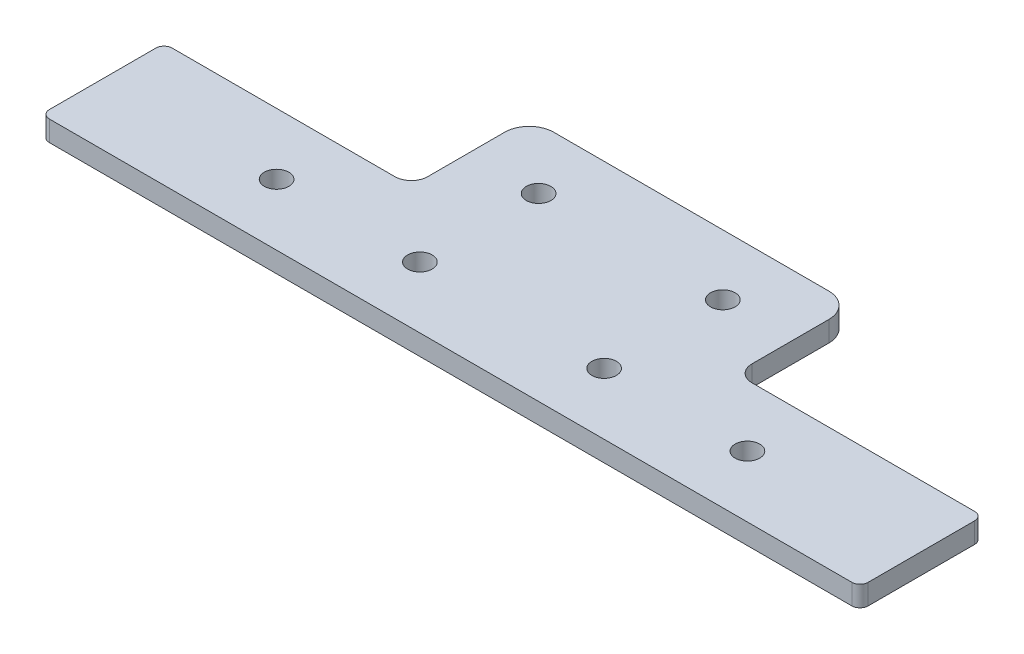
ISO-10303-21;
HEADER;
FILE_DESCRIPTION(('STEP AP214'),'2;1');
FILE_NAME('part.step','',(''),(''),'','','');
FILE_SCHEMA(('AUTOMOTIVE_DESIGN { 1 0 10303 214 1 1 1 1 }'));
ENDSEC;
DATA;
#1=APPLICATION_CONTEXT('core data for automotive mechanical design processes');
#2=APPLICATION_PROTOCOL_DEFINITION('international standard','automotive_design',2000,#1);
#3=PRODUCT_CONTEXT('',#1,'mechanical');
#4=PRODUCT('Part','Part','',(#3));
#5=PRODUCT_RELATED_PRODUCT_CATEGORY('part','',(#4));
#6=PRODUCT_DEFINITION_FORMATION('','',#4);
#7=PRODUCT_DEFINITION_CONTEXT('part definition',#1,'design');
#8=PRODUCT_DEFINITION('design','',#6,#7);
#9=PRODUCT_DEFINITION_SHAPE('','',#8);
#10=(LENGTH_UNIT() NAMED_UNIT(*) SI_UNIT(.MILLI.,.METRE.));
#11=(NAMED_UNIT(*) PLANE_ANGLE_UNIT() SI_UNIT($,.RADIAN.));
#12=(NAMED_UNIT(*) SI_UNIT($,.STERADIAN.) SOLID_ANGLE_UNIT());
#13=UNCERTAINTY_MEASURE_WITH_UNIT(LENGTH_MEASURE(1.E-05),#10,'distance_accuracy_value','');
#14=(GEOMETRIC_REPRESENTATION_CONTEXT(3) GLOBAL_UNCERTAINTY_ASSIGNED_CONTEXT((#13)) GLOBAL_UNIT_ASSIGNED_CONTEXT((#10,
#11,#12)) REPRESENTATION_CONTEXT('',''));
#15=CARTESIAN_POINT('',(0.,0.,0.));
#16=DIRECTION('',(0.,0.,1.));
#17=DIRECTION('',(1.,0.,0.));
#18=AXIS2_PLACEMENT_3D('',#15,#16,#17);
#19=CARTESIAN_POINT('',(-63.5,3.175,-9.525));
#20=DIRECTION('',(0.,0.,1.));
#21=DIRECTION('',(1.,0.,0.));
#22=AXIS2_PLACEMENT_3D('',#19,#20,#21);
#23=PLANE('',#22);
#24=DIRECTION('',(-1.,0.,0.));
#25=VECTOR('',#24,1.);
#26=CARTESIAN_POINT('',(-63.5,3.175,-9.525));
#27=LINE('',#26,#25);
#28=CARTESIAN_POINT('',(-27.686,3.175,-9.525));
#29=VERTEX_POINT('',#28);
#30=CARTESIAN_POINT('',(-62.23,3.175,-9.525));
#31=VERTEX_POINT('',#30);
#32=EDGE_CURVE('E280',#29,#31,#27,.T.);
#33=ORIENTED_EDGE('',*,*,#32,.F.);
#34=DIRECTION('',(0.,1.,0.));
#35=VECTOR('',#34,1.);
#36=CARTESIAN_POINT('',(-27.686,3.175,-9.525));
#37=LINE('',#36,#35);
#38=CARTESIAN_POINT('',(-27.686,0.,-9.525));
#39=VERTEX_POINT('',#38);
#40=EDGE_CURVE('E226',#29,#39,#37,.F.);
#41=ORIENTED_EDGE('',*,*,#40,.T.);
#42=DIRECTION('',(-1.,0.,0.));
#43=VECTOR('',#42,1.);
#44=CARTESIAN_POINT('',(-63.5,0.,-9.525));
#45=LINE('',#44,#43);
#46=CARTESIAN_POINT('',(-62.23,0.,-9.525));
#47=VERTEX_POINT('',#46);
#48=EDGE_CURVE('E178',#39,#47,#45,.T.);
#49=ORIENTED_EDGE('',*,*,#48,.T.);
#50=DIRECTION('',(0.,-1.,0.));
#51=VECTOR('',#50,1.);
#52=CARTESIAN_POINT('',(-62.23,3.175,-9.525));
#53=LINE('',#52,#51);
#54=EDGE_CURVE('E216',#47,#31,#53,.F.);
#55=ORIENTED_EDGE('',*,*,#54,.T.);
#56=EDGE_LOOP('',(#33,#41,#49,#55));
#57=FACE_BOUND('',#56,.T.);
#58=ADVANCED_FACE('F34',(#57),#23,.F.);
#59=CARTESIAN_POINT('',(63.5,3.175,9.525));
#60=DIRECTION('',(-1.,0.,0.));
#61=DIRECTION('',(0.,0.,1.));
#62=AXIS2_PLACEMENT_3D('',#59,#60,#61);
#63=PLANE('',#62);
#64=DIRECTION('',(0.,0.,-1.));
#65=VECTOR('',#64,1.);
#66=CARTESIAN_POINT('',(63.5,0.,9.525));
#67=LINE('',#66,#65);
#68=CARTESIAN_POINT('',(63.5,0.,8.255));
#69=VERTEX_POINT('',#68);
#70=CARTESIAN_POINT('',(63.5,0.,-8.255));
#71=VERTEX_POINT('',#70);
#72=EDGE_CURVE('E183',#69,#71,#67,.T.);
#73=ORIENTED_EDGE('',*,*,#72,.T.);
#74=DIRECTION('',(0.,-1.,0.));
#75=VECTOR('',#74,1.);
#76=CARTESIAN_POINT('',(63.5,3.175,-8.255));
#77=LINE('',#76,#75);
#78=CARTESIAN_POINT('',(63.5,3.175,-8.255));
#79=VERTEX_POINT('',#78);
#80=EDGE_CURVE('E155',#71,#79,#77,.F.);
#81=ORIENTED_EDGE('',*,*,#80,.T.);
#82=DIRECTION('',(0.,0.,-1.));
#83=VECTOR('',#82,1.);
#84=CARTESIAN_POINT('',(63.5,3.175,9.525));
#85=LINE('',#84,#83);
#86=CARTESIAN_POINT('',(63.5,3.175,8.255));
#87=VERTEX_POINT('',#86);
#88=EDGE_CURVE('E188',#87,#79,#85,.T.);
#89=ORIENTED_EDGE('',*,*,#88,.F.);
#90=DIRECTION('',(0.,-1.,0.));
#91=VECTOR('',#90,1.);
#92=CARTESIAN_POINT('',(63.5,3.175,8.255));
#93=LINE('',#92,#91);
#94=EDGE_CURVE('E159',#87,#69,#93,.T.);
#95=ORIENTED_EDGE('',*,*,#94,.T.);
#96=EDGE_LOOP('',(#73,#81,#89,#95));
#97=FACE_BOUND('',#96,.T.);
#98=ADVANCED_FACE('F296',(#97),#63,.F.);
#99=CARTESIAN_POINT('',(62.23,0.,-9.525));
#100=VERTEX_POINT('',#99);
#101=CARTESIAN_POINT('',(27.6859999999999,0.,-9.525));
#102=VERTEX_POINT('',#101);
#103=EDGE_CURVE('E167',#100,#102,#45,.T.);
#104=ORIENTED_EDGE('',*,*,#103,.T.);
#105=DIRECTION('',(0.,1.,0.));
#106=VECTOR('',#105,1.);
#107=CARTESIAN_POINT('',(27.6859999999999,3.175,-9.525));
#108=LINE('',#107,#106);
#109=CARTESIAN_POINT('',(27.6859999999999,3.175,-9.525));
#110=VERTEX_POINT('',#109);
#111=EDGE_CURVE('E219',#102,#110,#108,.T.);
#112=ORIENTED_EDGE('',*,*,#111,.T.);
#113=CARTESIAN_POINT('',(62.23,3.175,-9.525));
#114=VERTEX_POINT('',#113);
#115=EDGE_CURVE('E170',#114,#110,#27,.T.);
#116=ORIENTED_EDGE('',*,*,#115,.F.);
#117=DIRECTION('',(0.,-1.,0.));
#118=VECTOR('',#117,1.);
#119=CARTESIAN_POINT('',(62.23,3.175,-9.525));
#120=LINE('',#119,#118);
#121=EDGE_CURVE('E154',#114,#100,#120,.T.);
#122=ORIENTED_EDGE('',*,*,#121,.T.);
#123=EDGE_LOOP('',(#104,#112,#116,#122));
#124=FACE_BOUND('',#123,.T.);
#125=ADVANCED_FACE('F165',(#124),#23,.F.);
#126=CARTESIAN_POINT('',(-63.5,3.175,9.525));
#127=DIRECTION('',(1.,0.,0.));
#128=DIRECTION('',(0.,0.,-1.));
#129=AXIS2_PLACEMENT_3D('',#126,#127,#128);
#130=PLANE('',#129);
#131=DIRECTION('',(0.,0.,1.));
#132=VECTOR('',#131,1.);
#133=CARTESIAN_POINT('',(-63.5,3.175,9.525));
#134=LINE('',#133,#132);
#135=CARTESIAN_POINT('',(-63.5,3.175,-8.255));
#136=VERTEX_POINT('',#135);
#137=CARTESIAN_POINT('',(-63.5,3.175,8.255));
#138=VERTEX_POINT('',#137);
#139=EDGE_CURVE('E282',#136,#138,#134,.T.);
#140=ORIENTED_EDGE('',*,*,#139,.F.);
#141=DIRECTION('',(0.,-1.,0.));
#142=VECTOR('',#141,1.);
#143=CARTESIAN_POINT('',(-63.5,3.175,-8.255));
#144=LINE('',#143,#142);
#145=CARTESIAN_POINT('',(-63.5,0.,-8.255));
#146=VERTEX_POINT('',#145);
#147=EDGE_CURVE('E213',#136,#146,#144,.T.);
#148=ORIENTED_EDGE('',*,*,#147,.T.);
#149=DIRECTION('',(0.,0.,1.));
#150=VECTOR('',#149,1.);
#151=CARTESIAN_POINT('',(-63.5,0.,9.525));
#152=LINE('',#151,#150);
#153=CARTESIAN_POINT('',(-63.5,0.,8.255));
#154=VERTEX_POINT('',#153);
#155=EDGE_CURVE('E177',#146,#154,#152,.T.);
#156=ORIENTED_EDGE('',*,*,#155,.T.);
#157=DIRECTION('',(0.,-1.,0.));
#158=VECTOR('',#157,1.);
#159=CARTESIAN_POINT('',(-63.5,3.175,8.255));
#160=LINE('',#159,#158);
#161=EDGE_CURVE('E211',#154,#138,#160,.F.);
#162=ORIENTED_EDGE('',*,*,#161,.T.);
#163=EDGE_LOOP('',(#140,#148,#156,#162));
#164=FACE_BOUND('',#163,.T.);
#165=ADVANCED_FACE('F305',(#164),#130,.F.);
#166=CARTESIAN_POINT('',(-63.5,3.175,9.525));
#167=DIRECTION('',(0.,0.,-1.));
#168=DIRECTION('',(-1.,0.,0.));
#169=AXIS2_PLACEMENT_3D('',#166,#167,#168);
#170=PLANE('',#169);
#171=DIRECTION('',(1.,0.,0.));
#172=VECTOR('',#171,1.);
#173=CARTESIAN_POINT('',(-63.5,0.,9.525));
#174=LINE('',#173,#172);
#175=CARTESIAN_POINT('',(-62.23,0.,9.525));
#176=VERTEX_POINT('',#175);
#177=CARTESIAN_POINT('',(62.23,0.,9.525));
#178=VERTEX_POINT('',#177);
#179=EDGE_CURVE('E181',#176,#178,#174,.T.);
#180=ORIENTED_EDGE('',*,*,#179,.T.);
#181=DIRECTION('',(0.,-1.,0.));
#182=VECTOR('',#181,1.);
#183=CARTESIAN_POINT('',(62.23,3.175,9.525));
#184=LINE('',#183,#182);
#185=CARTESIAN_POINT('',(62.23,3.175,9.525));
#186=VERTEX_POINT('',#185);
#187=EDGE_CURVE('E209',#178,#186,#184,.F.);
#188=ORIENTED_EDGE('',*,*,#187,.T.);
#189=DIRECTION('',(1.,0.,0.));
#190=VECTOR('',#189,1.);
#191=CARTESIAN_POINT('',(-63.5,3.175,9.525));
#192=LINE('',#191,#190);
#193=CARTESIAN_POINT('',(-62.23,3.175,9.525));
#194=VERTEX_POINT('',#193);
#195=EDGE_CURVE('E172',#194,#186,#192,.T.);
#196=ORIENTED_EDGE('',*,*,#195,.F.);
#197=DIRECTION('',(0.,-1.,0.));
#198=VECTOR('',#197,1.);
#199=CARTESIAN_POINT('',(-62.23,3.175,9.525));
#200=LINE('',#199,#198);
#201=EDGE_CURVE('E206',#194,#176,#200,.T.);
#202=ORIENTED_EDGE('',*,*,#201,.T.);
#203=EDGE_LOOP('',(#180,#188,#196,#202));
#204=FACE_BOUND('',#203,.T.);
#205=ADVANCED_FACE('F298',(#204),#170,.F.);
#206=CARTESIAN_POINT('',(0.,3.175,0.));
#207=DIRECTION('',(0.,-1.,0.));
#208=DIRECTION('',(0.,0.,-1.));
#209=AXIS2_PLACEMENT_3D('',#206,#207,#208);
#210=PLANE('',#209);
#211=CARTESIAN_POINT('',(-36.5125,3.175,0.));
#212=DIRECTION('',(0.,1.,0.));
#213=DIRECTION('',(0.,0.,1.));
#214=AXIS2_PLACEMENT_3D('',#211,#212,#213);
#215=CIRCLE('',#214,1.905);
#216=CARTESIAN_POINT('',(-36.5125,3.175,1.905));
#217=VERTEX_POINT('',#216);
#218=EDGE_CURVE('E273',#217,#217,#215,.T.);
#219=ORIENTED_EDGE('',*,*,#218,.F.);
#220=EDGE_LOOP('',(#219));
#221=FACE_BOUND('',#220,.T.);
#222=CARTESIAN_POINT('',(14.2875,3.175,-18.415));
#223=DIRECTION('',(0.,1.,0.));
#224=DIRECTION('',(0.,0.,1.));
#225=AXIS2_PLACEMENT_3D('',#222,#223,#224);
#226=CIRCLE('',#225,1.90499999999999);
#227=CARTESIAN_POINT('',(14.2875,3.175,-16.51));
#228=VERTEX_POINT('',#227);
#229=EDGE_CURVE('E389',#228,#228,#226,.T.);
#230=ORIENTED_EDGE('',*,*,#229,.F.);
#231=EDGE_LOOP('',(#230));
#232=FACE_BOUND('',#231,.T.);
#233=CARTESIAN_POINT('',(-14.2875,3.175,-18.415));
#234=DIRECTION('',(0.,1.,0.));
#235=DIRECTION('',(0.,0.,1.));
#236=AXIS2_PLACEMENT_3D('',#233,#234,#235);
#237=CIRCLE('',#236,1.905);
#238=CARTESIAN_POINT('',(-14.2875,3.175,-16.51));
#239=VERTEX_POINT('',#238);
#240=EDGE_CURVE('E388',#239,#239,#237,.T.);
#241=ORIENTED_EDGE('',*,*,#240,.F.);
#242=EDGE_LOOP('',(#241));
#243=FACE_BOUND('',#242,.T.);
#244=CARTESIAN_POINT('',(-14.2875,3.175,0.));
#245=DIRECTION('',(0.,1.,0.));
#246=DIRECTION('',(0.,0.,1.));
#247=AXIS2_PLACEMENT_3D('',#244,#245,#246);
#248=CIRCLE('',#247,1.905);
#249=CARTESIAN_POINT('',(-14.2875,3.175,1.905));
#250=VERTEX_POINT('',#249);
#251=EDGE_CURVE('E403',#250,#250,#248,.T.);
#252=ORIENTED_EDGE('',*,*,#251,.F.);
#253=EDGE_LOOP('',(#252));
#254=FACE_BOUND('',#253,.T.);
#255=CARTESIAN_POINT('',(14.2875,3.175,0.));
#256=DIRECTION('',(0.,1.,0.));
#257=DIRECTION('',(0.,0.,1.));
#258=AXIS2_PLACEMENT_3D('',#255,#256,#257);
#259=CIRCLE('',#258,1.905);
#260=CARTESIAN_POINT('',(14.2875,3.175,1.90499999999999));
#261=VERTEX_POINT('',#260);
#262=EDGE_CURVE('E397',#261,#261,#259,.T.);
#263=ORIENTED_EDGE('',*,*,#262,.F.);
#264=EDGE_LOOP('',(#263));
#265=FACE_BOUND('',#264,.T.);
#266=CARTESIAN_POINT('',(36.5125,3.175,0.));
#267=DIRECTION('',(0.,1.,0.));
#268=DIRECTION('',(0.,0.,1.));
#269=AXIS2_PLACEMENT_3D('',#266,#267,#268);
#270=CIRCLE('',#269,1.905);
#271=CARTESIAN_POINT('',(36.5125,3.175,1.90499999999999));
#272=VERTEX_POINT('',#271);
#273=EDGE_CURVE('E382',#272,#272,#270,.T.);
#274=ORIENTED_EDGE('',*,*,#273,.F.);
#275=EDGE_LOOP('',(#274));
#276=FACE_BOUND('',#275,.T.);
#277=DIRECTION('',(-1.,0.,0.));
#278=VECTOR('',#277,1.);
#279=CARTESIAN_POINT('',(-25.146,3.175,-27.813));
#280=LINE('',#279,#278);
#281=CARTESIAN_POINT('',(21.3359999999999,3.175,-27.813));
#282=VERTEX_POINT('',#281);
#283=CARTESIAN_POINT('',(-21.336,3.175,-27.813));
#284=VERTEX_POINT('',#283);
#285=EDGE_CURVE('E264',#282,#284,#280,.T.);
#286=ORIENTED_EDGE('',*,*,#285,.T.);
#287=CARTESIAN_POINT('',(-21.336,3.175,-24.003));
#288=DIRECTION('',(0.,-1.,0.));
#289=DIRECTION('',(0.,0.,-1.));
#290=AXIS2_PLACEMENT_3D('',#287,#288,#289);
#291=CIRCLE('',#290,3.81);
#292=CARTESIAN_POINT('',(-25.146,3.175,-24.003));
#293=VERTEX_POINT('',#292);
#294=EDGE_CURVE('E243',#284,#293,#291,.F.);
#295=ORIENTED_EDGE('',*,*,#294,.T.);
#296=DIRECTION('',(0.,0.,1.));
#297=VECTOR('',#296,1.);
#298=CARTESIAN_POINT('',(-25.146,3.175,-9.525));
#299=LINE('',#298,#297);
#300=CARTESIAN_POINT('',(-25.146,3.175,-12.065));
#301=VERTEX_POINT('',#300);
#302=EDGE_CURVE('E262',#293,#301,#299,.T.);
#303=ORIENTED_EDGE('',*,*,#302,.T.);
#304=CARTESIAN_POINT('',(-27.686,3.175,-12.065));
#305=DIRECTION('',(0.,-1.,0.));
#306=DIRECTION('',(0.,0.,-1.));
#307=AXIS2_PLACEMENT_3D('',#304,#305,#306);
#308=CIRCLE('',#307,2.54);
#309=EDGE_CURVE('E231',#301,#29,#308,.T.);
#310=ORIENTED_EDGE('',*,*,#309,.T.);
#311=ORIENTED_EDGE('',*,*,#32,.T.);
#312=CARTESIAN_POINT('',(-62.23,3.175,-8.255));
#313=DIRECTION('',(0.,-1.,0.));
#314=DIRECTION('',(0.,0.,-1.));
#315=AXIS2_PLACEMENT_3D('',#312,#313,#314);
#316=CIRCLE('',#315,1.27);
#317=EDGE_CURVE('E200',#31,#136,#316,.F.);
#318=ORIENTED_EDGE('',*,*,#317,.T.);
#319=ORIENTED_EDGE('',*,*,#139,.T.);
#320=CARTESIAN_POINT('',(-62.23,3.175,8.255));
#321=DIRECTION('',(0.,-1.,0.));
#322=DIRECTION('',(0.,0.,-1.));
#323=AXIS2_PLACEMENT_3D('',#320,#321,#322);
#324=CIRCLE('',#323,1.27);
#325=EDGE_CURVE('E198',#138,#194,#324,.F.);
#326=ORIENTED_EDGE('',*,*,#325,.T.);
#327=ORIENTED_EDGE('',*,*,#195,.T.);
#328=CARTESIAN_POINT('',(62.23,3.175,8.255));
#329=DIRECTION('',(0.,-1.,0.));
#330=DIRECTION('',(0.,0.,-1.));
#331=AXIS2_PLACEMENT_3D('',#328,#329,#330);
#332=CIRCLE('',#331,1.27);
#333=EDGE_CURVE('E202',#186,#87,#332,.F.);
#334=ORIENTED_EDGE('',*,*,#333,.T.);
#335=ORIENTED_EDGE('',*,*,#88,.T.);
#336=CARTESIAN_POINT('',(62.23,3.175,-8.255));
#337=DIRECTION('',(0.,-1.,0.));
#338=DIRECTION('',(0.,0.,-1.));
#339=AXIS2_PLACEMENT_3D('',#336,#337,#338);
#340=CIRCLE('',#339,1.27);
#341=EDGE_CURVE('E204',#79,#114,#340,.F.);
#342=ORIENTED_EDGE('',*,*,#341,.T.);
#343=ORIENTED_EDGE('',*,*,#115,.T.);
#344=CARTESIAN_POINT('',(27.6859999999999,3.175,-12.065));
#345=DIRECTION('',(0.,-1.,0.));
#346=DIRECTION('',(0.,0.,-1.));
#347=AXIS2_PLACEMENT_3D('',#344,#345,#346);
#348=CIRCLE('',#347,2.54);
#349=CARTESIAN_POINT('',(25.146,3.175,-12.065));
#350=VERTEX_POINT('',#349);
#351=EDGE_CURVE('E228',#110,#350,#348,.T.);
#352=ORIENTED_EDGE('',*,*,#351,.T.);
#353=DIRECTION('',(0.,0.,-1.));
#354=VECTOR('',#353,1.);
#355=CARTESIAN_POINT('',(25.146,3.175,-9.525));
#356=LINE('',#355,#354);
#357=CARTESIAN_POINT('',(25.146,3.175,-24.003));
#358=VERTEX_POINT('',#357);
#359=EDGE_CURVE('E267',#350,#358,#356,.T.);
#360=ORIENTED_EDGE('',*,*,#359,.T.);
#361=CARTESIAN_POINT('',(21.3359999999999,3.175,-24.003));
#362=DIRECTION('',(0.,-1.,0.));
#363=DIRECTION('',(0.,0.,-1.));
#364=AXIS2_PLACEMENT_3D('',#361,#362,#363);
#365=CIRCLE('',#364,3.81);
#366=EDGE_CURVE('E241',#358,#282,#365,.F.);
#367=ORIENTED_EDGE('',*,*,#366,.T.);
#368=EDGE_LOOP('',(#286,#295,#303,#310,#311,#318,#319,#326,#327,#334,#335,#342,#343,#352,#360,#367));
#369=FACE_BOUND('',#368,.T.);
#370=ADVANCED_FACE('F261',(#221,#232,#243,#254,#265,#276,#369),#210,.F.);
#371=CARTESIAN_POINT('',(0.,0.,0.));
#372=DIRECTION('',(0.,-1.,0.));
#373=DIRECTION('',(0.,0.,-1.));
#374=AXIS2_PLACEMENT_3D('',#371,#372,#373);
#375=PLANE('',#374);
#376=CARTESIAN_POINT('',(-36.5125,0.,0.));
#377=DIRECTION('',(0.,1.,0.));
#378=DIRECTION('',(0.,0.,1.));
#379=AXIS2_PLACEMENT_3D('',#376,#377,#378);
#380=CIRCLE('',#379,1.905);
#381=CARTESIAN_POINT('',(-36.5125,0.,1.905));
#382=VERTEX_POINT('',#381);
#383=EDGE_CURVE('E268',#382,#382,#380,.T.);
#384=ORIENTED_EDGE('',*,*,#383,.T.);
#385=EDGE_LOOP('',(#384));
#386=FACE_BOUND('',#385,.T.);
#387=CARTESIAN_POINT('',(14.2875,0.,-18.415));
#388=DIRECTION('',(0.,1.,0.));
#389=DIRECTION('',(0.,0.,1.));
#390=AXIS2_PLACEMENT_3D('',#387,#388,#389);
#391=CIRCLE('',#390,1.90499999999999);
#392=CARTESIAN_POINT('',(14.2875,0.,-16.51));
#393=VERTEX_POINT('',#392);
#394=EDGE_CURVE('E385',#393,#393,#391,.T.);
#395=ORIENTED_EDGE('',*,*,#394,.T.);
#396=EDGE_LOOP('',(#395));
#397=FACE_BOUND('',#396,.T.);
#398=CARTESIAN_POINT('',(-14.2875,0.,-18.415));
#399=DIRECTION('',(0.,1.,0.));
#400=DIRECTION('',(0.,0.,1.));
#401=AXIS2_PLACEMENT_3D('',#398,#399,#400);
#402=CIRCLE('',#401,1.905);
#403=CARTESIAN_POINT('',(-14.2875,0.,-16.51));
#404=VERTEX_POINT('',#403);
#405=EDGE_CURVE('E406',#404,#404,#402,.T.);
#406=ORIENTED_EDGE('',*,*,#405,.T.);
#407=EDGE_LOOP('',(#406));
#408=FACE_BOUND('',#407,.T.);
#409=CARTESIAN_POINT('',(-14.2875,0.,0.));
#410=DIRECTION('',(0.,1.,0.));
#411=DIRECTION('',(0.,0.,1.));
#412=AXIS2_PLACEMENT_3D('',#409,#410,#411);
#413=CIRCLE('',#412,1.905);
#414=CARTESIAN_POINT('',(-14.2875,0.,1.905));
#415=VERTEX_POINT('',#414);
#416=EDGE_CURVE('E400',#415,#415,#413,.T.);
#417=ORIENTED_EDGE('',*,*,#416,.T.);
#418=EDGE_LOOP('',(#417));
#419=FACE_BOUND('',#418,.T.);
#420=CARTESIAN_POINT('',(14.2875,0.,0.));
#421=DIRECTION('',(0.,1.,0.));
#422=DIRECTION('',(0.,0.,1.));
#423=AXIS2_PLACEMENT_3D('',#420,#421,#422);
#424=CIRCLE('',#423,1.905);
#425=CARTESIAN_POINT('',(14.2875,0.,1.90499999999999));
#426=VERTEX_POINT('',#425);
#427=EDGE_CURVE('E394',#426,#426,#424,.T.);
#428=ORIENTED_EDGE('',*,*,#427,.T.);
#429=EDGE_LOOP('',(#428));
#430=FACE_BOUND('',#429,.T.);
#431=CARTESIAN_POINT('',(36.5125,0.,0.));
#432=DIRECTION('',(0.,1.,0.));
#433=DIRECTION('',(0.,0.,1.));
#434=AXIS2_PLACEMENT_3D('',#431,#432,#433);
#435=CIRCLE('',#434,1.905);
#436=CARTESIAN_POINT('',(36.5125,0.,1.90499999999999));
#437=VERTEX_POINT('',#436);
#438=EDGE_CURVE('E379',#437,#437,#435,.T.);
#439=ORIENTED_EDGE('',*,*,#438,.T.);
#440=EDGE_LOOP('',(#439));
#441=FACE_BOUND('',#440,.T.);
#442=DIRECTION('',(0.,0.,1.));
#443=VECTOR('',#442,1.);
#444=CARTESIAN_POINT('',(-25.146,0.,-9.525));
#445=LINE('',#444,#443);
#446=CARTESIAN_POINT('',(-25.146,0.,-24.003));
#447=VERTEX_POINT('',#446);
#448=CARTESIAN_POINT('',(-25.146,0.,-12.065));
#449=VERTEX_POINT('',#448);
#450=EDGE_CURVE('E249',#447,#449,#445,.T.);
#451=ORIENTED_EDGE('',*,*,#450,.F.);
#452=CARTESIAN_POINT('',(-21.336,0.,-24.003));
#453=DIRECTION('',(0.,-1.,0.));
#454=DIRECTION('',(0.,0.,-1.));
#455=AXIS2_PLACEMENT_3D('',#452,#453,#454);
#456=CIRCLE('',#455,3.81);
#457=CARTESIAN_POINT('',(-21.336,0.,-27.813));
#458=VERTEX_POINT('',#457);
#459=EDGE_CURVE('E42',#447,#458,#456,.T.);
#460=ORIENTED_EDGE('',*,*,#459,.T.);
#461=DIRECTION('',(-1.,0.,0.));
#462=VECTOR('',#461,1.);
#463=CARTESIAN_POINT('',(-25.146,0.,-27.813));
#464=LINE('',#463,#462);
#465=CARTESIAN_POINT('',(21.3359999999999,0.,-27.813));
#466=VERTEX_POINT('',#465);
#467=EDGE_CURVE('E248',#466,#458,#464,.T.);
#468=ORIENTED_EDGE('',*,*,#467,.F.);
#469=CARTESIAN_POINT('',(21.3359999999999,0.,-24.003));
#470=DIRECTION('',(0.,-1.,0.));
#471=DIRECTION('',(0.,0.,-1.));
#472=AXIS2_PLACEMENT_3D('',#469,#470,#471);
#473=CIRCLE('',#472,3.81);
#474=CARTESIAN_POINT('',(25.146,0.,-24.003));
#475=VERTEX_POINT('',#474);
#476=EDGE_CURVE('E49',#466,#475,#473,.T.);
#477=ORIENTED_EDGE('',*,*,#476,.T.);
#478=DIRECTION('',(0.,0.,-1.));
#479=VECTOR('',#478,1.);
#480=CARTESIAN_POINT('',(25.146,0.,-9.525));
#481=LINE('',#480,#479);
#482=CARTESIAN_POINT('',(25.146,0.,-12.065));
#483=VERTEX_POINT('',#482);
#484=EDGE_CURVE('E257',#483,#475,#481,.T.);
#485=ORIENTED_EDGE('',*,*,#484,.F.);
#486=CARTESIAN_POINT('',(27.6859999999999,0.,-12.065));
#487=DIRECTION('',(0.,-1.,0.));
#488=DIRECTION('',(0.,0.,-1.));
#489=AXIS2_PLACEMENT_3D('',#486,#487,#488);
#490=CIRCLE('',#489,2.54);
#491=EDGE_CURVE('E176',#483,#102,#490,.F.);
#492=ORIENTED_EDGE('',*,*,#491,.T.);
#493=ORIENTED_EDGE('',*,*,#103,.F.);
#494=CARTESIAN_POINT('',(62.23,0.,-8.255));
#495=DIRECTION('',(0.,-1.,0.));
#496=DIRECTION('',(0.,0.,-1.));
#497=AXIS2_PLACEMENT_3D('',#494,#495,#496);
#498=CIRCLE('',#497,1.27);
#499=EDGE_CURVE('E150',#100,#71,#498,.T.);
#500=ORIENTED_EDGE('',*,*,#499,.T.);
#501=ORIENTED_EDGE('',*,*,#72,.F.);
#502=CARTESIAN_POINT('',(62.23,0.,8.255));
#503=DIRECTION('',(0.,-1.,0.));
#504=DIRECTION('',(0.,0.,-1.));
#505=AXIS2_PLACEMENT_3D('',#502,#503,#504);
#506=CIRCLE('',#505,1.27);
#507=EDGE_CURVE('E160',#69,#178,#506,.T.);
#508=ORIENTED_EDGE('',*,*,#507,.T.);
#509=ORIENTED_EDGE('',*,*,#179,.F.);
#510=CARTESIAN_POINT('',(-62.23,0.,8.255));
#511=DIRECTION('',(0.,-1.,0.));
#512=DIRECTION('',(0.,0.,-1.));
#513=AXIS2_PLACEMENT_3D('',#510,#511,#512);
#514=CIRCLE('',#513,1.27);
#515=EDGE_CURVE('E171',#176,#154,#514,.T.);
#516=ORIENTED_EDGE('',*,*,#515,.T.);
#517=ORIENTED_EDGE('',*,*,#155,.F.);
#518=CARTESIAN_POINT('',(-62.23,0.,-8.255));
#519=DIRECTION('',(0.,-1.,0.));
#520=DIRECTION('',(0.,0.,-1.));
#521=AXIS2_PLACEMENT_3D('',#518,#519,#520);
#522=CIRCLE('',#521,1.27);
#523=EDGE_CURVE('E191',#146,#47,#522,.T.);
#524=ORIENTED_EDGE('',*,*,#523,.T.);
#525=ORIENTED_EDGE('',*,*,#48,.F.);
#526=CARTESIAN_POINT('',(-27.686,0.,-12.065));
#527=DIRECTION('',(0.,-1.,0.));
#528=DIRECTION('',(0.,0.,-1.));
#529=AXIS2_PLACEMENT_3D('',#526,#527,#528);
#530=CIRCLE('',#529,2.54);
#531=EDGE_CURVE('E233',#39,#449,#530,.F.);
#532=ORIENTED_EDGE('',*,*,#531,.T.);
#533=EDGE_LOOP('',(#451,#460,#468,#477,#485,#492,#493,#500,#501,#508,#509,#516,#517,#524,#525,#532));
#534=FACE_BOUND('',#533,.T.);
#535=ADVANCED_FACE('F174',(#386,#397,#408,#419,#430,#441,#534),#375,.T.);
#536=CARTESIAN_POINT('',(-25.146,0.,-9.525));
#537=DIRECTION('',(-1.,0.,0.));
#538=DIRECTION('',(0.,0.,1.));
#539=AXIS2_PLACEMENT_3D('',#536,#537,#538);
#540=PLANE('',#539);
#541=ORIENTED_EDGE('',*,*,#302,.F.);
#542=DIRECTION('',(0.,1.,0.));
#543=VECTOR('',#542,1.);
#544=CARTESIAN_POINT('',(-25.146,0.,-24.003));
#545=LINE('',#544,#543);
#546=EDGE_CURVE('E57',#293,#447,#545,.F.);
#547=ORIENTED_EDGE('',*,*,#546,.T.);
#548=ORIENTED_EDGE('',*,*,#450,.T.);
#549=DIRECTION('',(0.,1.,0.));
#550=VECTOR('',#549,1.);
#551=CARTESIAN_POINT('',(-25.146,0.,-12.065));
#552=LINE('',#551,#550);
#553=EDGE_CURVE('E223',#449,#301,#552,.T.);
#554=ORIENTED_EDGE('',*,*,#553,.T.);
#555=EDGE_LOOP('',(#541,#547,#548,#554));
#556=FACE_BOUND('',#555,.T.);
#557=ADVANCED_FACE('F265',(#556),#540,.T.);
#558=CARTESIAN_POINT('',(-25.146,0.,-27.813));
#559=DIRECTION('',(0.,0.,-1.));
#560=DIRECTION('',(-1.,0.,0.));
#561=AXIS2_PLACEMENT_3D('',#558,#559,#560);
#562=PLANE('',#561);
#563=ORIENTED_EDGE('',*,*,#467,.T.);
#564=DIRECTION('',(0.,1.,0.));
#565=VECTOR('',#564,1.);
#566=CARTESIAN_POINT('',(-21.336,0.,-27.813));
#567=LINE('',#566,#565);
#568=EDGE_CURVE('E238',#458,#284,#567,.T.);
#569=ORIENTED_EDGE('',*,*,#568,.T.);
#570=ORIENTED_EDGE('',*,*,#285,.F.);
#571=DIRECTION('',(0.,1.,0.));
#572=VECTOR('',#571,1.);
#573=CARTESIAN_POINT('',(21.3359999999999,0.,-27.813));
#574=LINE('',#573,#572);
#575=EDGE_CURVE('E236',#282,#466,#574,.F.);
#576=ORIENTED_EDGE('',*,*,#575,.T.);
#577=EDGE_LOOP('',(#563,#569,#570,#576));
#578=FACE_BOUND('',#577,.T.);
#579=ADVANCED_FACE('F253',(#578),#562,.T.);
#580=CARTESIAN_POINT('',(25.146,0.,-9.525));
#581=DIRECTION('',(1.,0.,0.));
#582=DIRECTION('',(0.,0.,-1.));
#583=AXIS2_PLACEMENT_3D('',#580,#581,#582);
#584=PLANE('',#583);
#585=ORIENTED_EDGE('',*,*,#484,.T.);
#586=DIRECTION('',(0.,1.,0.));
#587=VECTOR('',#586,1.);
#588=CARTESIAN_POINT('',(25.146,0.,-24.003));
#589=LINE('',#588,#587);
#590=EDGE_CURVE('E11',#475,#358,#589,.T.);
#591=ORIENTED_EDGE('',*,*,#590,.T.);
#592=ORIENTED_EDGE('',*,*,#359,.F.);
#593=DIRECTION('',(0.,1.,0.));
#594=VECTOR('',#593,1.);
#595=CARTESIAN_POINT('',(25.146,0.,-12.065));
#596=LINE('',#595,#594);
#597=EDGE_CURVE('E221',#350,#483,#596,.F.);
#598=ORIENTED_EDGE('',*,*,#597,.T.);
#599=EDGE_LOOP('',(#585,#591,#592,#598));
#600=FACE_BOUND('',#599,.T.);
#601=ADVANCED_FACE('F342',(#600),#584,.T.);
#602=CARTESIAN_POINT('',(36.5125,0.,0.));
#603=DIRECTION('',(0.,1.,0.));
#604=DIRECTION('',(0.,0.,1.));
#605=AXIS2_PLACEMENT_3D('',#602,#603,#604);
#606=CYLINDRICAL_SURFACE('',#605,1.905);
#607=ORIENTED_EDGE('',*,*,#438,.F.);
#608=EDGE_LOOP('',(#607));
#609=FACE_BOUND('',#608,.T.);
#610=ORIENTED_EDGE('',*,*,#273,.T.);
#611=EDGE_LOOP('',(#610));
#612=FACE_BOUND('',#611,.T.);
#613=ADVANCED_FACE('F345',(#609,#612),#606,.F.);
#614=CARTESIAN_POINT('',(14.2875,0.,0.));
#615=DIRECTION('',(0.,1.,0.));
#616=DIRECTION('',(0.,0.,1.));
#617=AXIS2_PLACEMENT_3D('',#614,#615,#616);
#618=CYLINDRICAL_SURFACE('',#617,1.905);
#619=ORIENTED_EDGE('',*,*,#427,.F.);
#620=EDGE_LOOP('',(#619));
#621=FACE_BOUND('',#620,.T.);
#622=ORIENTED_EDGE('',*,*,#262,.T.);
#623=EDGE_LOOP('',(#622));
#624=FACE_BOUND('',#623,.T.);
#625=ADVANCED_FACE('F357',(#621,#624),#618,.F.);
#626=CARTESIAN_POINT('',(-14.2875,0.,0.));
#627=DIRECTION('',(0.,1.,0.));
#628=DIRECTION('',(0.,0.,1.));
#629=AXIS2_PLACEMENT_3D('',#626,#627,#628);
#630=CYLINDRICAL_SURFACE('',#629,1.905);
#631=ORIENTED_EDGE('',*,*,#416,.F.);
#632=EDGE_LOOP('',(#631));
#633=FACE_BOUND('',#632,.T.);
#634=ORIENTED_EDGE('',*,*,#251,.T.);
#635=EDGE_LOOP('',(#634));
#636=FACE_BOUND('',#635,.T.);
#637=ADVANCED_FACE('F353',(#633,#636),#630,.F.);
#638=CARTESIAN_POINT('',(-14.2875,0.,-18.415));
#639=DIRECTION('',(0.,1.,0.));
#640=DIRECTION('',(0.,0.,1.));
#641=AXIS2_PLACEMENT_3D('',#638,#639,#640);
#642=CYLINDRICAL_SURFACE('',#641,1.905);
#643=ORIENTED_EDGE('',*,*,#405,.F.);
#644=EDGE_LOOP('',(#643));
#645=FACE_BOUND('',#644,.T.);
#646=ORIENTED_EDGE('',*,*,#240,.T.);
#647=EDGE_LOOP('',(#646));
#648=FACE_BOUND('',#647,.T.);
#649=ADVANCED_FACE('F349',(#645,#648),#642,.F.);
#650=CARTESIAN_POINT('',(14.2875,0.,-18.415));
#651=DIRECTION('',(0.,1.,0.));
#652=DIRECTION('',(0.,0.,1.));
#653=AXIS2_PLACEMENT_3D('',#650,#651,#652);
#654=CYLINDRICAL_SURFACE('',#653,1.90499999999999);
#655=ORIENTED_EDGE('',*,*,#394,.F.);
#656=EDGE_LOOP('',(#655));
#657=FACE_BOUND('',#656,.T.);
#658=ORIENTED_EDGE('',*,*,#229,.T.);
#659=EDGE_LOOP('',(#658));
#660=FACE_BOUND('',#659,.T.);
#661=ADVANCED_FACE('F352',(#657,#660),#654,.F.);
#662=CARTESIAN_POINT('',(-36.5125,0.,0.));
#663=DIRECTION('',(0.,1.,0.));
#664=DIRECTION('',(0.,0.,1.));
#665=AXIS2_PLACEMENT_3D('',#662,#663,#664);
#666=CYLINDRICAL_SURFACE('',#665,1.905);
#667=ORIENTED_EDGE('',*,*,#383,.F.);
#668=EDGE_LOOP('',(#667));
#669=FACE_BOUND('',#668,.T.);
#670=ORIENTED_EDGE('',*,*,#218,.T.);
#671=EDGE_LOOP('',(#670));
#672=FACE_BOUND('',#671,.T.);
#673=ADVANCED_FACE('F367',(#669,#672),#666,.F.);
#674=CARTESIAN_POINT('',(62.23,3.175,-8.255));
#675=DIRECTION('',(0.,-1.,0.));
#676=DIRECTION('',(0.,0.,-1.));
#677=AXIS2_PLACEMENT_3D('',#674,#675,#676);
#678=CYLINDRICAL_SURFACE('',#677,1.27);
#679=ORIENTED_EDGE('',*,*,#341,.F.);
#680=ORIENTED_EDGE('',*,*,#80,.F.);
#681=ORIENTED_EDGE('',*,*,#499,.F.);
#682=ORIENTED_EDGE('',*,*,#121,.F.);
#683=EDGE_LOOP('',(#679,#680,#681,#682));
#684=FACE_BOUND('',#683,.T.);
#685=ADVANCED_FACE('F153',(#684),#678,.T.);
#686=CARTESIAN_POINT('',(62.23,3.175,8.255));
#687=DIRECTION('',(0.,-1.,0.));
#688=DIRECTION('',(0.,0.,-1.));
#689=AXIS2_PLACEMENT_3D('',#686,#687,#688);
#690=CYLINDRICAL_SURFACE('',#689,1.27);
#691=ORIENTED_EDGE('',*,*,#333,.F.);
#692=ORIENTED_EDGE('',*,*,#187,.F.);
#693=ORIENTED_EDGE('',*,*,#507,.F.);
#694=ORIENTED_EDGE('',*,*,#94,.F.);
#695=EDGE_LOOP('',(#691,#692,#693,#694));
#696=FACE_BOUND('',#695,.T.);
#697=ADVANCED_FACE('F294',(#696),#690,.T.);
#698=CARTESIAN_POINT('',(-62.23,3.175,-8.255));
#699=DIRECTION('',(0.,-1.,0.));
#700=DIRECTION('',(0.,0.,-1.));
#701=AXIS2_PLACEMENT_3D('',#698,#699,#700);
#702=CYLINDRICAL_SURFACE('',#701,1.27);
#703=ORIENTED_EDGE('',*,*,#317,.F.);
#704=ORIENTED_EDGE('',*,*,#54,.F.);
#705=ORIENTED_EDGE('',*,*,#523,.F.);
#706=ORIENTED_EDGE('',*,*,#147,.F.);
#707=EDGE_LOOP('',(#703,#704,#705,#706));
#708=FACE_BOUND('',#707,.T.);
#709=ADVANCED_FACE('F309',(#708),#702,.T.);
#710=CARTESIAN_POINT('',(-62.23,3.175,8.255));
#711=DIRECTION('',(0.,-1.,0.));
#712=DIRECTION('',(0.,0.,-1.));
#713=AXIS2_PLACEMENT_3D('',#710,#711,#712);
#714=CYLINDRICAL_SURFACE('',#713,1.27);
#715=ORIENTED_EDGE('',*,*,#325,.F.);
#716=ORIENTED_EDGE('',*,*,#161,.F.);
#717=ORIENTED_EDGE('',*,*,#515,.F.);
#718=ORIENTED_EDGE('',*,*,#201,.F.);
#719=EDGE_LOOP('',(#715,#716,#717,#718));
#720=FACE_BOUND('',#719,.T.);
#721=ADVANCED_FACE('F300',(#720),#714,.T.);
#722=CARTESIAN_POINT('',(27.6859999999999,3.175,-12.065));
#723=DIRECTION('',(0.,1.,0.));
#724=DIRECTION('',(0.,0.,1.));
#725=AXIS2_PLACEMENT_3D('',#722,#723,#724);
#726=CYLINDRICAL_SURFACE('',#725,2.54);
#727=ORIENTED_EDGE('',*,*,#491,.F.);
#728=ORIENTED_EDGE('',*,*,#597,.F.);
#729=ORIENTED_EDGE('',*,*,#351,.F.);
#730=ORIENTED_EDGE('',*,*,#111,.F.);
#731=EDGE_LOOP('',(#727,#728,#729,#730));
#732=FACE_BOUND('',#731,.T.);
#733=ADVANCED_FACE('F416',(#732),#726,.F.);
#734=CARTESIAN_POINT('',(-27.686,0.,-12.065));
#735=DIRECTION('',(0.,1.,0.));
#736=DIRECTION('',(0.,0.,1.));
#737=AXIS2_PLACEMENT_3D('',#734,#735,#736);
#738=CYLINDRICAL_SURFACE('',#737,2.54);
#739=ORIENTED_EDGE('',*,*,#531,.F.);
#740=ORIENTED_EDGE('',*,*,#40,.F.);
#741=ORIENTED_EDGE('',*,*,#309,.F.);
#742=ORIENTED_EDGE('',*,*,#553,.F.);
#743=EDGE_LOOP('',(#739,#740,#741,#742));
#744=FACE_BOUND('',#743,.T.);
#745=ADVANCED_FACE('F316',(#744),#738,.F.);
#746=CARTESIAN_POINT('',(-21.336,0.,-24.003));
#747=DIRECTION('',(0.,1.,0.));
#748=DIRECTION('',(0.,0.,1.));
#749=AXIS2_PLACEMENT_3D('',#746,#747,#748);
#750=CYLINDRICAL_SURFACE('',#749,3.81);
#751=ORIENTED_EDGE('',*,*,#459,.F.);
#752=ORIENTED_EDGE('',*,*,#546,.F.);
#753=ORIENTED_EDGE('',*,*,#294,.F.);
#754=ORIENTED_EDGE('',*,*,#568,.F.);
#755=EDGE_LOOP('',(#751,#752,#753,#754));
#756=FACE_BOUND('',#755,.T.);
#757=ADVANCED_FACE('F259',(#756),#750,.T.);
#758=CARTESIAN_POINT('',(21.3359999999999,0.,-24.003));
#759=DIRECTION('',(0.,1.,0.));
#760=DIRECTION('',(0.,0.,1.));
#761=AXIS2_PLACEMENT_3D('',#758,#759,#760);
#762=CYLINDRICAL_SURFACE('',#761,3.81);
#763=ORIENTED_EDGE('',*,*,#476,.F.);
#764=ORIENTED_EDGE('',*,*,#575,.F.);
#765=ORIENTED_EDGE('',*,*,#366,.F.);
#766=ORIENTED_EDGE('',*,*,#590,.F.);
#767=EDGE_LOOP('',(#763,#764,#765,#766));
#768=FACE_BOUND('',#767,.T.);
#769=ADVANCED_FACE('F36',(#768),#762,.T.);
#770=CLOSED_SHELL('',(#58,#98,#125,#165,#205,#370,#535,#557,#579,#601,#613,#625,#637,#649,#661,
#673,#685,#697,#709,#721,#733,#745,#757,#769));
#771=MANIFOLD_SOLID_BREP('B2',#770);
#772=ADVANCED_BREP_SHAPE_REPRESENTATION('',(#18,#771),#14);
#773=SHAPE_DEFINITION_REPRESENTATION(#9,#772);
ENDSEC;
END-ISO-10303-21;
